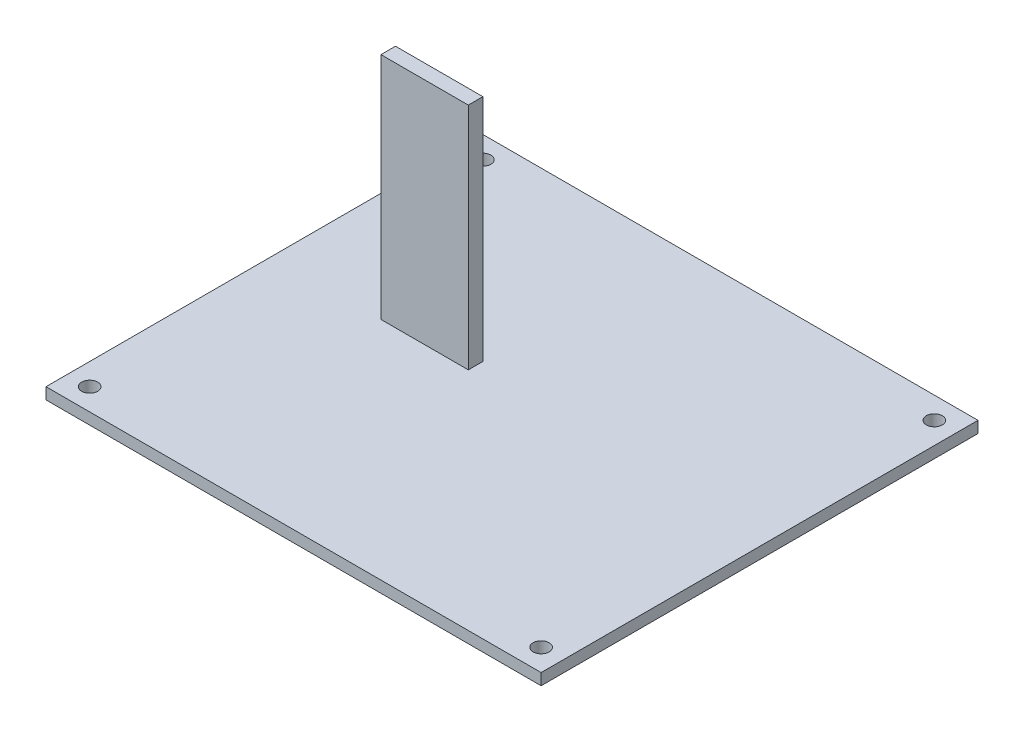
ISO-10303-21;
HEADER;
FILE_DESCRIPTION(('STEP AP214'),'2;1');
FILE_NAME('part.step','',(''),(''),'','','');
FILE_SCHEMA(('AUTOMOTIVE_DESIGN { 1 0 10303 214 1 1 1 1 }'));
ENDSEC;
DATA;
#1=APPLICATION_CONTEXT('core data for automotive mechanical design processes');
#2=APPLICATION_PROTOCOL_DEFINITION('international standard','automotive_design',2000,#1);
#3=PRODUCT_CONTEXT('',#1,'mechanical');
#4=PRODUCT('Part','Part','',(#3));
#5=PRODUCT_RELATED_PRODUCT_CATEGORY('part','',(#4));
#6=PRODUCT_DEFINITION_FORMATION('','',#4);
#7=PRODUCT_DEFINITION_CONTEXT('part definition',#1,'design');
#8=PRODUCT_DEFINITION('design','',#6,#7);
#9=PRODUCT_DEFINITION_SHAPE('','',#8);
#10=(LENGTH_UNIT() NAMED_UNIT(*) SI_UNIT(.MILLI.,.METRE.));
#11=(NAMED_UNIT(*) PLANE_ANGLE_UNIT() SI_UNIT($,.RADIAN.));
#12=(NAMED_UNIT(*) SI_UNIT($,.STERADIAN.) SOLID_ANGLE_UNIT());
#13=UNCERTAINTY_MEASURE_WITH_UNIT(LENGTH_MEASURE(1.E-05),#10,'distance_accuracy_value','');
#14=(GEOMETRIC_REPRESENTATION_CONTEXT(3) GLOBAL_UNCERTAINTY_ASSIGNED_CONTEXT((#13)) GLOBAL_UNIT_ASSIGNED_CONTEXT((#10,
#11,#12)) REPRESENTATION_CONTEXT('',''));
#15=CARTESIAN_POINT('',(0.,0.,0.));
#16=DIRECTION('',(0.,0.,1.));
#17=DIRECTION('',(1.,0.,0.));
#18=AXIS2_PLACEMENT_3D('',#15,#16,#17);
#19=CARTESIAN_POINT('',(0.,2.,0.));
#20=DIRECTION('',(0.,-1.,0.));
#21=DIRECTION('',(0.,0.,-1.));
#22=AXIS2_PLACEMENT_3D('',#19,#20,#21);
#23=PLANE('',#22);
#24=CARTESIAN_POINT('',(39.37,2.,-34.29));
#25=DIRECTION('',(0.,1.,0.));
#26=DIRECTION('',(0.,0.,1.));
#27=AXIS2_PLACEMENT_3D('',#24,#25,#26);
#28=CIRCLE('',#27,1.39700000000001);
#29=CARTESIAN_POINT('',(39.37,2.,-32.893));
#30=VERTEX_POINT('',#29);
#31=EDGE_CURVE('E121',#30,#30,#28,.T.);
#32=ORIENTED_EDGE('',*,*,#31,.F.);
#33=EDGE_LOOP('',(#32));
#34=FACE_BOUND('',#33,.T.);
#35=CARTESIAN_POINT('',(-39.37,2.,34.29));
#36=DIRECTION('',(0.,1.,0.));
#37=DIRECTION('',(0.,0.,1.));
#38=AXIS2_PLACEMENT_3D('',#35,#36,#37);
#39=CIRCLE('',#38,1.39700000000001);
#40=CARTESIAN_POINT('',(-39.37,2.,35.687));
#41=VERTEX_POINT('',#40);
#42=EDGE_CURVE('E130',#41,#41,#39,.T.);
#43=ORIENTED_EDGE('',*,*,#42,.F.);
#44=EDGE_LOOP('',(#43));
#45=FACE_BOUND('',#44,.T.);
#46=CARTESIAN_POINT('',(39.37,2.,34.29));
#47=DIRECTION('',(0.,1.,0.));
#48=DIRECTION('',(0.,0.,1.));
#49=AXIS2_PLACEMENT_3D('',#46,#47,#48);
#50=CIRCLE('',#49,1.39700000000001);
#51=CARTESIAN_POINT('',(39.37,2.,35.687));
#52=VERTEX_POINT('',#51);
#53=EDGE_CURVE('E136',#52,#52,#50,.T.);
#54=ORIENTED_EDGE('',*,*,#53,.F.);
#55=EDGE_LOOP('',(#54));
#56=FACE_BOUND('',#55,.T.);
#57=CARTESIAN_POINT('',(-39.37,2.,-34.29));
#58=DIRECTION('',(0.,1.,0.));
#59=DIRECTION('',(0.,0.,1.));
#60=AXIS2_PLACEMENT_3D('',#57,#58,#59);
#61=CIRCLE('',#60,1.39700000000001);
#62=CARTESIAN_POINT('',(-39.37,2.,-32.893));
#63=VERTEX_POINT('',#62);
#64=EDGE_CURVE('E142',#63,#63,#61,.T.);
#65=ORIENTED_EDGE('',*,*,#64,.F.);
#66=EDGE_LOOP('',(#65));
#67=FACE_BOUND('',#66,.T.);
#68=DIRECTION('',(0.,0.,-1.));
#69=VECTOR('',#68,1.);
#70=CARTESIAN_POINT('',(43.18,2.,38.1));
#71=LINE('',#70,#69);
#72=CARTESIAN_POINT('',(43.18,2.,38.1));
#73=VERTEX_POINT('',#72);
#74=CARTESIAN_POINT('',(43.18,2.,-38.1));
#75=VERTEX_POINT('',#74);
#76=EDGE_CURVE('E148',#73,#75,#71,.T.);
#77=ORIENTED_EDGE('',*,*,#76,.T.);
#78=DIRECTION('',(-1.,0.,0.));
#79=VECTOR('',#78,1.);
#80=CARTESIAN_POINT('',(-43.18,2.,-38.1));
#81=LINE('',#80,#79);
#82=CARTESIAN_POINT('',(-43.18,2.,-38.1));
#83=VERTEX_POINT('',#82);
#84=EDGE_CURVE('E151',#75,#83,#81,.T.);
#85=ORIENTED_EDGE('',*,*,#84,.T.);
#86=DIRECTION('',(0.,0.,1.));
#87=VECTOR('',#86,1.);
#88=CARTESIAN_POINT('',(-43.18,2.,38.1));
#89=LINE('',#88,#87);
#90=CARTESIAN_POINT('',(-43.18,2.,38.1));
#91=VERTEX_POINT('',#90);
#92=EDGE_CURVE('E154',#83,#91,#89,.T.);
#93=ORIENTED_EDGE('',*,*,#92,.T.);
#94=DIRECTION('',(1.,0.,0.));
#95=VECTOR('',#94,1.);
#96=CARTESIAN_POINT('',(-43.18,2.,38.1));
#97=LINE('',#96,#95);
#98=EDGE_CURVE('E156',#91,#73,#97,.T.);
#99=ORIENTED_EDGE('',*,*,#98,.T.);
#100=EDGE_LOOP('',(#77,#85,#93,#99));
#101=FACE_BOUND('',#100,.T.);
#102=DIRECTION('',(0.,0.,-1.));
#103=VECTOR('',#102,1.);
#104=CARTESIAN_POINT('',(-8.89000000000001,2.,-3.81));
#105=LINE('',#104,#103);
#106=CARTESIAN_POINT('',(-8.89000000000001,2.,-1.27));
#107=VERTEX_POINT('',#106);
#108=CARTESIAN_POINT('',(-8.89000000000001,2.,-3.81));
#109=VERTEX_POINT('',#108);
#110=EDGE_CURVE('E117',#107,#109,#105,.T.);
#111=ORIENTED_EDGE('',*,*,#110,.F.);
#112=DIRECTION('',(1.,0.,0.));
#113=VECTOR('',#112,1.);
#114=CARTESIAN_POINT('',(-24.13,2.,-1.27));
#115=LINE('',#114,#113);
#116=CARTESIAN_POINT('',(-24.13,2.,-1.27));
#117=VERTEX_POINT('',#116);
#118=EDGE_CURVE('E114',#117,#107,#115,.T.);
#119=ORIENTED_EDGE('',*,*,#118,.F.);
#120=DIRECTION('',(0.,0.,1.));
#121=VECTOR('',#120,1.);
#122=CARTESIAN_POINT('',(-24.13,2.,-3.81));
#123=LINE('',#122,#121);
#124=CARTESIAN_POINT('',(-24.13,2.,-3.81));
#125=VERTEX_POINT('',#124);
#126=EDGE_CURVE('E52',#125,#117,#123,.T.);
#127=ORIENTED_EDGE('',*,*,#126,.F.);
#128=DIRECTION('',(-1.,0.,0.));
#129=VECTOR('',#128,1.);
#130=CARTESIAN_POINT('',(-24.13,2.,-3.81));
#131=LINE('',#130,#129);
#132=EDGE_CURVE('E47',#109,#125,#131,.T.);
#133=ORIENTED_EDGE('',*,*,#132,.F.);
#134=EDGE_LOOP('',(#111,#119,#127,#133));
#135=FACE_BOUND('',#134,.T.);
#136=ADVANCED_FACE('F32',(#34,#45,#56,#67,#101,#135),#23,.F.);
#137=CARTESIAN_POINT('',(0.,0.,0.));
#138=DIRECTION('',(0.,-1.,0.));
#139=DIRECTION('',(0.,0.,-1.));
#140=AXIS2_PLACEMENT_3D('',#137,#138,#139);
#141=PLANE('',#140);
#142=CARTESIAN_POINT('',(-39.37,0.,34.29));
#143=DIRECTION('',(0.,1.,0.));
#144=DIRECTION('',(0.,0.,1.));
#145=AXIS2_PLACEMENT_3D('',#142,#143,#144);
#146=CIRCLE('',#145,1.39700000000001);
#147=CARTESIAN_POINT('',(-39.37,0.,35.687));
#148=VERTEX_POINT('',#147);
#149=EDGE_CURVE('E128',#148,#148,#146,.T.);
#150=ORIENTED_EDGE('',*,*,#149,.T.);
#151=EDGE_LOOP('',(#150));
#152=FACE_BOUND('',#151,.T.);
#153=CARTESIAN_POINT('',(-39.37,0.,-34.29));
#154=DIRECTION('',(0.,1.,0.));
#155=DIRECTION('',(0.,0.,1.));
#156=AXIS2_PLACEMENT_3D('',#153,#154,#155);
#157=CIRCLE('',#156,1.39700000000001);
#158=CARTESIAN_POINT('',(-39.37,0.,-32.893));
#159=VERTEX_POINT('',#158);
#160=EDGE_CURVE('E139',#159,#159,#157,.T.);
#161=ORIENTED_EDGE('',*,*,#160,.T.);
#162=EDGE_LOOP('',(#161));
#163=FACE_BOUND('',#162,.T.);
#164=DIRECTION('',(0.,0.,-1.));
#165=VECTOR('',#164,1.);
#166=CARTESIAN_POINT('',(43.18,0.,38.1));
#167=LINE('',#166,#165);
#168=CARTESIAN_POINT('',(43.18,0.,38.1));
#169=VERTEX_POINT('',#168);
#170=CARTESIAN_POINT('',(43.18,0.,-38.1));
#171=VERTEX_POINT('',#170);
#172=EDGE_CURVE('E145',#169,#171,#167,.T.);
#173=ORIENTED_EDGE('',*,*,#172,.F.);
#174=DIRECTION('',(1.,0.,0.));
#175=VECTOR('',#174,1.);
#176=CARTESIAN_POINT('',(-43.18,0.,38.1));
#177=LINE('',#176,#175);
#178=CARTESIAN_POINT('',(-43.18,0.,38.1));
#179=VERTEX_POINT('',#178);
#180=EDGE_CURVE('E152',#179,#169,#177,.T.);
#181=ORIENTED_EDGE('',*,*,#180,.F.);
#182=DIRECTION('',(0.,0.,1.));
#183=VECTOR('',#182,1.);
#184=CARTESIAN_POINT('',(-43.18,0.,38.1));
#185=LINE('',#184,#183);
#186=CARTESIAN_POINT('',(-43.18,0.,-38.1));
#187=VERTEX_POINT('',#186);
#188=EDGE_CURVE('E163',#187,#179,#185,.T.);
#189=ORIENTED_EDGE('',*,*,#188,.F.);
#190=DIRECTION('',(-1.,0.,0.));
#191=VECTOR('',#190,1.);
#192=CARTESIAN_POINT('',(-43.18,0.,-38.1));
#193=LINE('',#192,#191);
#194=EDGE_CURVE('E161',#171,#187,#193,.T.);
#195=ORIENTED_EDGE('',*,*,#194,.F.);
#196=EDGE_LOOP('',(#173,#181,#189,#195));
#197=FACE_BOUND('',#196,.T.);
#198=CARTESIAN_POINT('',(39.37,0.,34.29));
#199=DIRECTION('',(0.,1.,0.));
#200=DIRECTION('',(0.,0.,1.));
#201=AXIS2_PLACEMENT_3D('',#198,#199,#200);
#202=CIRCLE('',#201,1.39700000000001);
#203=CARTESIAN_POINT('',(39.37,0.,35.687));
#204=VERTEX_POINT('',#203);
#205=EDGE_CURVE('E133',#204,#204,#202,.T.);
#206=ORIENTED_EDGE('',*,*,#205,.T.);
#207=EDGE_LOOP('',(#206));
#208=FACE_BOUND('',#207,.T.);
#209=CARTESIAN_POINT('',(39.37,0.,-34.29));
#210=DIRECTION('',(0.,1.,0.));
#211=DIRECTION('',(0.,0.,1.));
#212=AXIS2_PLACEMENT_3D('',#209,#210,#211);
#213=CIRCLE('',#212,1.39700000000001);
#214=CARTESIAN_POINT('',(39.37,0.,-32.893));
#215=VERTEX_POINT('',#214);
#216=EDGE_CURVE('E118',#215,#215,#213,.T.);
#217=ORIENTED_EDGE('',*,*,#216,.T.);
#218=EDGE_LOOP('',(#217));
#219=FACE_BOUND('',#218,.T.);
#220=ADVANCED_FACE('F181',(#152,#163,#197,#208,#219),#141,.T.);
#221=CARTESIAN_POINT('',(43.18,2.,38.1));
#222=DIRECTION('',(-1.,0.,0.));
#223=DIRECTION('',(0.,0.,1.));
#224=AXIS2_PLACEMENT_3D('',#221,#222,#223);
#225=PLANE('',#224);
#226=ORIENTED_EDGE('',*,*,#172,.T.);
#227=DIRECTION('',(0.,-1.,0.));
#228=VECTOR('',#227,1.);
#229=CARTESIAN_POINT('',(43.18,2.,-38.1));
#230=LINE('',#229,#228);
#231=EDGE_CURVE('E11',#75,#171,#230,.T.);
#232=ORIENTED_EDGE('',*,*,#231,.F.);
#233=ORIENTED_EDGE('',*,*,#76,.F.);
#234=DIRECTION('',(0.,-1.,0.));
#235=VECTOR('',#234,1.);
#236=CARTESIAN_POINT('',(43.18,2.,38.1));
#237=LINE('',#236,#235);
#238=EDGE_CURVE('E158',#73,#169,#237,.T.);
#239=ORIENTED_EDGE('',*,*,#238,.T.);
#240=EDGE_LOOP('',(#226,#232,#233,#239));
#241=FACE_BOUND('',#240,.T.);
#242=ADVANCED_FACE('F34',(#241),#225,.F.);
#243=CARTESIAN_POINT('',(-43.18,2.,-38.1));
#244=DIRECTION('',(0.,0.,1.));
#245=DIRECTION('',(1.,0.,0.));
#246=AXIS2_PLACEMENT_3D('',#243,#244,#245);
#247=PLANE('',#246);
#248=ORIENTED_EDGE('',*,*,#194,.T.);
#249=DIRECTION('',(0.,-1.,0.));
#250=VECTOR('',#249,1.);
#251=CARTESIAN_POINT('',(-43.18,2.,-38.1));
#252=LINE('',#251,#250);
#253=EDGE_CURVE('E40',#83,#187,#252,.T.);
#254=ORIENTED_EDGE('',*,*,#253,.F.);
#255=ORIENTED_EDGE('',*,*,#84,.F.);
#256=ORIENTED_EDGE('',*,*,#231,.T.);
#257=EDGE_LOOP('',(#248,#254,#255,#256));
#258=FACE_BOUND('',#257,.T.);
#259=ADVANCED_FACE('F191',(#258),#247,.F.);
#260=CARTESIAN_POINT('',(-43.18,2.,38.1));
#261=DIRECTION('',(1.,0.,0.));
#262=DIRECTION('',(0.,0.,-1.));
#263=AXIS2_PLACEMENT_3D('',#260,#261,#262);
#264=PLANE('',#263);
#265=ORIENTED_EDGE('',*,*,#188,.T.);
#266=DIRECTION('',(0.,-1.,0.));
#267=VECTOR('',#266,1.);
#268=CARTESIAN_POINT('',(-43.18,2.,38.1));
#269=LINE('',#268,#267);
#270=EDGE_CURVE('E168',#91,#179,#269,.T.);
#271=ORIENTED_EDGE('',*,*,#270,.F.);
#272=ORIENTED_EDGE('',*,*,#92,.F.);
#273=ORIENTED_EDGE('',*,*,#253,.T.);
#274=EDGE_LOOP('',(#265,#271,#272,#273));
#275=FACE_BOUND('',#274,.T.);
#276=ADVANCED_FACE('F175',(#275),#264,.F.);
#277=CARTESIAN_POINT('',(-43.18,2.,38.1));
#278=DIRECTION('',(0.,0.,-1.));
#279=DIRECTION('',(-1.,0.,0.));
#280=AXIS2_PLACEMENT_3D('',#277,#278,#279);
#281=PLANE('',#280);
#282=ORIENTED_EDGE('',*,*,#180,.T.);
#283=ORIENTED_EDGE('',*,*,#238,.F.);
#284=ORIENTED_EDGE('',*,*,#98,.F.);
#285=ORIENTED_EDGE('',*,*,#270,.T.);
#286=EDGE_LOOP('',(#282,#283,#284,#285));
#287=FACE_BOUND('',#286,.T.);
#288=ADVANCED_FACE('F185',(#287),#281,.F.);
#289=CARTESIAN_POINT('',(-39.37,2.,-34.29));
#290=DIRECTION('',(0.,-1.,0.));
#291=DIRECTION('',(0.,0.,-1.));
#292=AXIS2_PLACEMENT_3D('',#289,#290,#291);
#293=CYLINDRICAL_SURFACE('',#292,1.39700000000001);
#294=ORIENTED_EDGE('',*,*,#64,.T.);
#295=EDGE_LOOP('',(#294));
#296=FACE_BOUND('',#295,.T.);
#297=ORIENTED_EDGE('',*,*,#160,.F.);
#298=EDGE_LOOP('',(#297));
#299=FACE_BOUND('',#298,.T.);
#300=ADVANCED_FACE('F209',(#296,#299),#293,.F.);
#301=CARTESIAN_POINT('',(39.37,2.,34.29));
#302=DIRECTION('',(0.,-1.,0.));
#303=DIRECTION('',(0.,0.,-1.));
#304=AXIS2_PLACEMENT_3D('',#301,#302,#303);
#305=CYLINDRICAL_SURFACE('',#304,1.39700000000001);
#306=ORIENTED_EDGE('',*,*,#53,.T.);
#307=EDGE_LOOP('',(#306));
#308=FACE_BOUND('',#307,.T.);
#309=ORIENTED_EDGE('',*,*,#205,.F.);
#310=EDGE_LOOP('',(#309));
#311=FACE_BOUND('',#310,.T.);
#312=ADVANCED_FACE('F216',(#308,#311),#305,.F.);
#313=CARTESIAN_POINT('',(-39.37,2.,34.29));
#314=DIRECTION('',(0.,-1.,0.));
#315=DIRECTION('',(0.,0.,-1.));
#316=AXIS2_PLACEMENT_3D('',#313,#314,#315);
#317=CYLINDRICAL_SURFACE('',#316,1.39700000000001);
#318=ORIENTED_EDGE('',*,*,#42,.T.);
#319=EDGE_LOOP('',(#318));
#320=FACE_BOUND('',#319,.T.);
#321=ORIENTED_EDGE('',*,*,#149,.F.);
#322=EDGE_LOOP('',(#321));
#323=FACE_BOUND('',#322,.T.);
#324=ADVANCED_FACE('F221',(#320,#323),#317,.F.);
#325=CARTESIAN_POINT('',(39.37,2.,-34.29));
#326=DIRECTION('',(0.,-1.,0.));
#327=DIRECTION('',(0.,0.,-1.));
#328=AXIS2_PLACEMENT_3D('',#325,#326,#327);
#329=CYLINDRICAL_SURFACE('',#328,1.39700000000001);
#330=ORIENTED_EDGE('',*,*,#31,.T.);
#331=EDGE_LOOP('',(#330));
#332=FACE_BOUND('',#331,.T.);
#333=ORIENTED_EDGE('',*,*,#216,.F.);
#334=EDGE_LOOP('',(#333));
#335=FACE_BOUND('',#334,.T.);
#336=ADVANCED_FACE('F231',(#332,#335),#329,.F.);
#337=CARTESIAN_POINT('',(-8.89000000000001,42.,-3.81));
#338=DIRECTION('',(-1.,0.,0.));
#339=DIRECTION('',(0.,0.,1.));
#340=AXIS2_PLACEMENT_3D('',#337,#338,#339);
#341=PLANE('',#340);
#342=ORIENTED_EDGE('',*,*,#110,.T.);
#343=DIRECTION('',(0.,-1.,0.));
#344=VECTOR('',#343,1.);
#345=CARTESIAN_POINT('',(-8.89000000000001,42.,-3.81));
#346=LINE('',#345,#344);
#347=CARTESIAN_POINT('',(-8.89000000000001,42.,-3.81));
#348=VERTEX_POINT('',#347);
#349=EDGE_CURVE('E98',#348,#109,#346,.T.);
#350=ORIENTED_EDGE('',*,*,#349,.F.);
#351=DIRECTION('',(0.,0.,-1.));
#352=VECTOR('',#351,1.);
#353=CARTESIAN_POINT('',(-8.89000000000001,42.,-3.81));
#354=LINE('',#353,#352);
#355=CARTESIAN_POINT('',(-8.89000000000001,42.,-1.27));
#356=VERTEX_POINT('',#355);
#357=EDGE_CURVE('E105',#356,#348,#354,.T.);
#358=ORIENTED_EDGE('',*,*,#357,.F.);
#359=DIRECTION('',(0.,-1.,0.));
#360=VECTOR('',#359,1.);
#361=CARTESIAN_POINT('',(-8.89000000000001,42.,-1.27));
#362=LINE('',#361,#360);
#363=EDGE_CURVE('E334',#356,#107,#362,.T.);
#364=ORIENTED_EDGE('',*,*,#363,.T.);
#365=EDGE_LOOP('',(#342,#350,#358,#364));
#366=FACE_BOUND('',#365,.T.);
#367=ADVANCED_FACE('F116',(#366),#341,.F.);
#368=CARTESIAN_POINT('',(-24.13,42.,-3.81));
#369=DIRECTION('',(0.,0.,1.));
#370=DIRECTION('',(1.,0.,0.));
#371=AXIS2_PLACEMENT_3D('',#368,#369,#370);
#372=PLANE('',#371);
#373=ORIENTED_EDGE('',*,*,#132,.T.);
#374=DIRECTION('',(0.,-1.,0.));
#375=VECTOR('',#374,1.);
#376=CARTESIAN_POINT('',(-24.13,42.,-3.81));
#377=LINE('',#376,#375);
#378=CARTESIAN_POINT('',(-24.13,42.,-3.81));
#379=VERTEX_POINT('',#378);
#380=EDGE_CURVE('E101',#379,#125,#377,.T.);
#381=ORIENTED_EDGE('',*,*,#380,.F.);
#382=DIRECTION('',(-1.,0.,0.));
#383=VECTOR('',#382,1.);
#384=CARTESIAN_POINT('',(-24.13,42.,-3.81));
#385=LINE('',#384,#383);
#386=EDGE_CURVE('E94',#348,#379,#385,.T.);
#387=ORIENTED_EDGE('',*,*,#386,.F.);
#388=ORIENTED_EDGE('',*,*,#349,.T.);
#389=EDGE_LOOP('',(#373,#381,#387,#388));
#390=FACE_BOUND('',#389,.T.);
#391=ADVANCED_FACE('F96',(#390),#372,.F.);
#392=CARTESIAN_POINT('',(-24.13,42.,-3.81));
#393=DIRECTION('',(1.,0.,0.));
#394=DIRECTION('',(0.,0.,-1.));
#395=AXIS2_PLACEMENT_3D('',#392,#393,#394);
#396=PLANE('',#395);
#397=ORIENTED_EDGE('',*,*,#126,.T.);
#398=DIRECTION('',(0.,-1.,0.));
#399=VECTOR('',#398,1.);
#400=CARTESIAN_POINT('',(-24.13,42.,-1.27));
#401=LINE('',#400,#399);
#402=CARTESIAN_POINT('',(-24.13,42.,-1.27));
#403=VERTEX_POINT('',#402);
#404=EDGE_CURVE('E123',#403,#117,#401,.T.);
#405=ORIENTED_EDGE('',*,*,#404,.F.);
#406=DIRECTION('',(0.,0.,1.));
#407=VECTOR('',#406,1.);
#408=CARTESIAN_POINT('',(-24.13,42.,-3.81));
#409=LINE('',#408,#407);
#410=EDGE_CURVE('E104',#379,#403,#409,.T.);
#411=ORIENTED_EDGE('',*,*,#410,.F.);
#412=ORIENTED_EDGE('',*,*,#380,.T.);
#413=EDGE_LOOP('',(#397,#405,#411,#412));
#414=FACE_BOUND('',#413,.T.);
#415=ADVANCED_FACE('F243',(#414),#396,.F.);
#416=CARTESIAN_POINT('',(-24.13,42.,-1.27));
#417=DIRECTION('',(0.,0.,-1.));
#418=DIRECTION('',(-1.,0.,0.));
#419=AXIS2_PLACEMENT_3D('',#416,#417,#418);
#420=PLANE('',#419);
#421=ORIENTED_EDGE('',*,*,#118,.T.);
#422=ORIENTED_EDGE('',*,*,#363,.F.);
#423=DIRECTION('',(1.,0.,0.));
#424=VECTOR('',#423,1.);
#425=CARTESIAN_POINT('',(-24.13,42.,-1.27));
#426=LINE('',#425,#424);
#427=EDGE_CURVE('E110',#403,#356,#426,.T.);
#428=ORIENTED_EDGE('',*,*,#427,.F.);
#429=ORIENTED_EDGE('',*,*,#404,.T.);
#430=EDGE_LOOP('',(#421,#422,#428,#429));
#431=FACE_BOUND('',#430,.T.);
#432=ADVANCED_FACE('F246',(#431),#420,.F.);
#433=CARTESIAN_POINT('',(0.,42.,0.));
#434=DIRECTION('',(0.,1.,0.));
#435=DIRECTION('',(0.,0.,1.));
#436=AXIS2_PLACEMENT_3D('',#433,#434,#435);
#437=PLANE('',#436);
#438=ORIENTED_EDGE('',*,*,#357,.T.);
#439=ORIENTED_EDGE('',*,*,#386,.T.);
#440=ORIENTED_EDGE('',*,*,#410,.T.);
#441=ORIENTED_EDGE('',*,*,#427,.T.);
#442=EDGE_LOOP('',(#438,#439,#440,#441));
#443=FACE_BOUND('',#442,.T.);
#444=ADVANCED_FACE('F108',(#443),#437,.T.);
#445=CLOSED_SHELL('',(#136,#220,#242,#259,#276,#288,#300,#312,#324,#336,#367,#391,#415,#432,#444));
#446=MANIFOLD_SOLID_BREP('B2',#445);
#447=ADVANCED_BREP_SHAPE_REPRESENTATION('',(#18,#446),#14);
#448=SHAPE_DEFINITION_REPRESENTATION(#9,#447);
ENDSEC;
END-ISO-10303-21;
